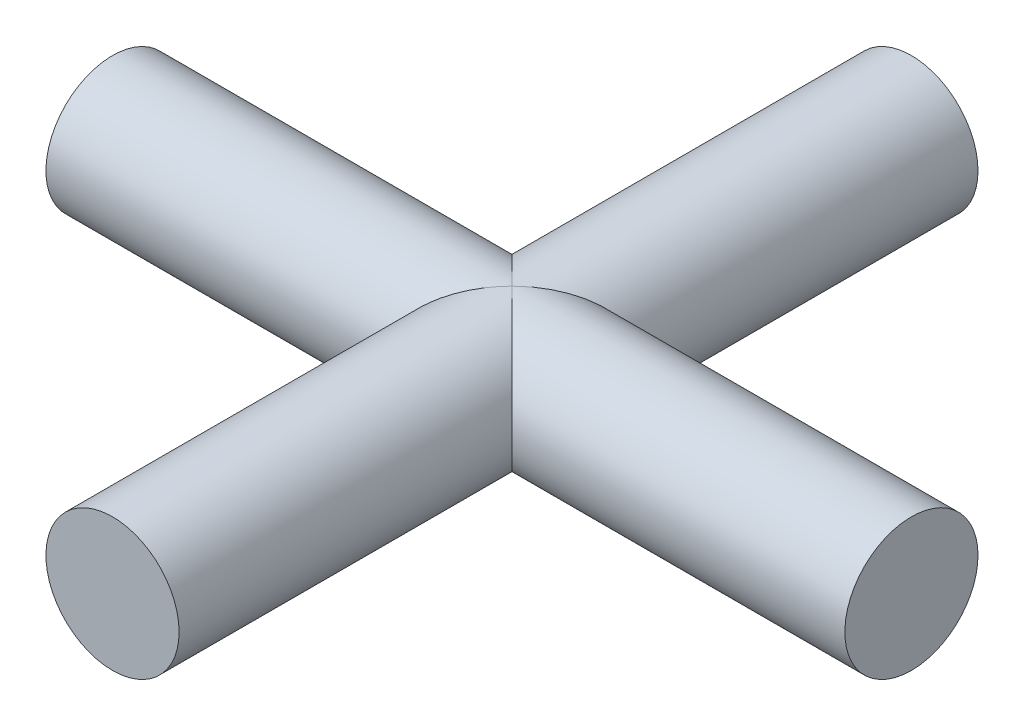
ISO-10303-21;
HEADER;
FILE_DESCRIPTION(('STEP AP214'),'2;1');
FILE_NAME('part.step','',(''),(''),'','','');
FILE_SCHEMA(('AUTOMOTIVE_DESIGN { 1 0 10303 214 1 1 1 1 }'));
ENDSEC;
DATA;
#1=APPLICATION_CONTEXT('core data for automotive mechanical design processes');
#2=APPLICATION_PROTOCOL_DEFINITION('international standard','automotive_design',2000,#1);
#3=PRODUCT_CONTEXT('',#1,'mechanical');
#4=PRODUCT('Part','Part','',(#3));
#5=PRODUCT_RELATED_PRODUCT_CATEGORY('part','',(#4));
#6=PRODUCT_DEFINITION_FORMATION('','',#4);
#7=PRODUCT_DEFINITION_CONTEXT('part definition',#1,'design');
#8=PRODUCT_DEFINITION('design','',#6,#7);
#9=PRODUCT_DEFINITION_SHAPE('','',#8);
#10=(LENGTH_UNIT() NAMED_UNIT(*) SI_UNIT(.MILLI.,.METRE.));
#11=(NAMED_UNIT(*) PLANE_ANGLE_UNIT() SI_UNIT($,.RADIAN.));
#12=(NAMED_UNIT(*) SI_UNIT($,.STERADIAN.) SOLID_ANGLE_UNIT());
#13=UNCERTAINTY_MEASURE_WITH_UNIT(LENGTH_MEASURE(1.E-05),#10,'distance_accuracy_value','');
#14=(GEOMETRIC_REPRESENTATION_CONTEXT(3) GLOBAL_UNCERTAINTY_ASSIGNED_CONTEXT((#13)) GLOBAL_UNIT_ASSIGNED_CONTEXT((#10,
#11,#12)) REPRESENTATION_CONTEXT('',''));
#15=CARTESIAN_POINT('',(0.,0.,0.));
#16=DIRECTION('',(0.,0.,1.));
#17=DIRECTION('',(1.,0.,0.));
#18=AXIS2_PLACEMENT_3D('',#15,#16,#17);
#19=CARTESIAN_POINT('',(0.,0.,15.));
#20=DIRECTION('',(0.,0.,-1.));
#21=DIRECTION('',(-1.,0.,0.));
#22=AXIS2_PLACEMENT_3D('',#19,#20,#21);
#23=CYLINDRICAL_SURFACE('',#22,2.5);
#24=CARTESIAN_POINT('',(0.,0.,15.));
#25=DIRECTION('',(0.,0.,1.));
#26=DIRECTION('',(1.,0.,0.));
#27=AXIS2_PLACEMENT_3D('',#24,#25,#26);
#28=CIRCLE('',#27,2.5);
#29=CARTESIAN_POINT('',(2.5,0.,15.));
#30=VERTEX_POINT('',#29);
#31=EDGE_CURVE('E59',#30,#30,#28,.T.);
#32=ORIENTED_EDGE('',*,*,#31,.F.);
#33=EDGE_LOOP('',(#32));
#34=FACE_BOUND('',#33,.T.);
#35=CARTESIAN_POINT('',(0.,0.,0.));
#36=DIRECTION('',(-0.707106781186547,0.,-0.707106781186547));
#37=DIRECTION('',(0.707106781186547,0.,-0.707106781186547));
#38=AXIS2_PLACEMENT_3D('',#35,#36,#37);
#39=ELLIPSE('',#38,3.53553390593274,2.5);
#40=CARTESIAN_POINT('',(0.,-2.5,0.));
#41=VERTEX_POINT('',#40);
#42=CARTESIAN_POINT('',(0.,2.5,0.));
#43=VERTEX_POINT('',#42);
#44=EDGE_CURVE('E43',#41,#43,#39,.T.);
#45=ORIENTED_EDGE('',*,*,#44,.F.);
#46=CARTESIAN_POINT('',(0.,0.,0.));
#47=DIRECTION('',(0.707106781186547,0.,-0.707106781186547));
#48=DIRECTION('',(-0.707106781186547,0.,-0.707106781186547));
#49=AXIS2_PLACEMENT_3D('',#46,#47,#48);
#50=ELLIPSE('',#49,3.53553390593274,2.5);
#51=EDGE_CURVE('E55',#43,#41,#50,.T.);
#52=ORIENTED_EDGE('',*,*,#51,.F.);
#53=EDGE_LOOP('',(#45,#52));
#54=FACE_BOUND('',#53,.T.);
#55=ADVANCED_FACE('F35',(#34,#54),#23,.T.);
#56=CARTESIAN_POINT('',(0.,0.,15.));
#57=DIRECTION('',(0.,0.,1.));
#58=DIRECTION('',(1.,0.,0.));
#59=AXIS2_PLACEMENT_3D('',#56,#57,#58);
#60=PLANE('',#59);
#61=ORIENTED_EDGE('',*,*,#31,.T.);
#62=EDGE_LOOP('',(#61));
#63=FACE_BOUND('',#62,.T.);
#64=ADVANCED_FACE('F82',(#63),#60,.T.);
#65=CARTESIAN_POINT('',(-15.,0.,0.));
#66=DIRECTION('',(1.,0.,0.));
#67=DIRECTION('',(0.,0.,-1.));
#68=AXIS2_PLACEMENT_3D('',#65,#66,#67);
#69=PLANE('',#68);
#70=CARTESIAN_POINT('',(-15.,0.,0.));
#71=DIRECTION('',(1.,0.,0.));
#72=DIRECTION('',(0.,0.,-1.));
#73=AXIS2_PLACEMENT_3D('',#70,#71,#72);
#74=CIRCLE('',#73,2.5);
#75=CARTESIAN_POINT('',(-15.,0.,-2.5));
#76=VERTEX_POINT('',#75);
#77=EDGE_CURVE('E96',#76,#76,#74,.T.);
#78=ORIENTED_EDGE('',*,*,#77,.F.);
#79=EDGE_LOOP('',(#78));
#80=FACE_BOUND('',#79,.T.);
#81=ADVANCED_FACE('F79',(#80),#69,.F.);
#82=CARTESIAN_POINT('',(15.,0.,0.));
#83=DIRECTION('',(-1.,0.,0.));
#84=DIRECTION('',(0.,0.,1.));
#85=AXIS2_PLACEMENT_3D('',#82,#83,#84);
#86=CYLINDRICAL_SURFACE('',#85,2.5);
#87=ORIENTED_EDGE('',*,*,#77,.T.);
#88=EDGE_LOOP('',(#87));
#89=FACE_BOUND('',#88,.T.);
#90=CARTESIAN_POINT('',(0.,0.,0.));
#91=DIRECTION('',(0.707106781186547,0.,-0.707106781186547));
#92=DIRECTION('',(-0.707106781186547,0.,-0.707106781186547));
#93=AXIS2_PLACEMENT_3D('',#90,#91,#92);
#94=ELLIPSE('',#93,3.53553390593274,2.5);
#95=EDGE_CURVE('E49',#43,#41,#94,.F.);
#96=ORIENTED_EDGE('',*,*,#95,.T.);
#97=ORIENTED_EDGE('',*,*,#44,.T.);
#98=EDGE_LOOP('',(#96,#97));
#99=FACE_BOUND('',#98,.T.);
#100=ADVANCED_FACE('F61',(#89,#99),#86,.T.);
#101=CARTESIAN_POINT('',(0.,0.,-15.));
#102=DIRECTION('',(0.,0.,1.));
#103=DIRECTION('',(1.,0.,0.));
#104=AXIS2_PLACEMENT_3D('',#101,#102,#103);
#105=PLANE('',#104);
#106=CARTESIAN_POINT('',(0.,0.,-15.));
#107=DIRECTION('',(0.,0.,1.));
#108=DIRECTION('',(1.,0.,0.));
#109=AXIS2_PLACEMENT_3D('',#106,#107,#108);
#110=CIRCLE('',#109,2.5);
#111=CARTESIAN_POINT('',(2.5,0.,-15.));
#112=VERTEX_POINT('',#111);
#113=EDGE_CURVE('E90',#112,#112,#110,.T.);
#114=ORIENTED_EDGE('',*,*,#113,.F.);
#115=EDGE_LOOP('',(#114));
#116=FACE_BOUND('',#115,.T.);
#117=ADVANCED_FACE('F73',(#116),#105,.F.);
#118=ORIENTED_EDGE('',*,*,#113,.T.);
#119=EDGE_LOOP('',(#118));
#120=FACE_BOUND('',#119,.T.);
#121=CARTESIAN_POINT('',(0.,0.,0.));
#122=DIRECTION('',(-0.707106781186547,0.,-0.707106781186547));
#123=DIRECTION('',(0.707106781186547,0.,-0.707106781186547));
#124=AXIS2_PLACEMENT_3D('',#121,#122,#123);
#125=ELLIPSE('',#124,3.53553390593274,2.5);
#126=EDGE_CURVE('E11',#41,#43,#125,.F.);
#127=ORIENTED_EDGE('',*,*,#126,.F.);
#128=ORIENTED_EDGE('',*,*,#95,.F.);
#129=EDGE_LOOP('',(#127,#128));
#130=FACE_BOUND('',#129,.T.);
#131=ADVANCED_FACE('F37',(#120,#130),#23,.T.);
#132=CARTESIAN_POINT('',(15.,0.,0.));
#133=DIRECTION('',(1.,0.,0.));
#134=DIRECTION('',(0.,0.,-1.));
#135=AXIS2_PLACEMENT_3D('',#132,#133,#134);
#136=CIRCLE('',#135,2.5);
#137=CARTESIAN_POINT('',(15.,0.,-2.5));
#138=VERTEX_POINT('',#137);
#139=EDGE_CURVE('E93',#138,#138,#136,.T.);
#140=ORIENTED_EDGE('',*,*,#139,.F.);
#141=EDGE_LOOP('',(#140));
#142=FACE_BOUND('',#141,.T.);
#143=ORIENTED_EDGE('',*,*,#51,.T.);
#144=ORIENTED_EDGE('',*,*,#126,.T.);
#145=EDGE_LOOP('',(#143,#144));
#146=FACE_BOUND('',#145,.T.);
#147=ADVANCED_FACE('F62',(#142,#146),#86,.T.);
#148=CARTESIAN_POINT('',(15.,0.,0.));
#149=DIRECTION('',(1.,0.,0.));
#150=DIRECTION('',(0.,0.,-1.));
#151=AXIS2_PLACEMENT_3D('',#148,#149,#150);
#152=PLANE('',#151);
#153=ORIENTED_EDGE('',*,*,#139,.T.);
#154=EDGE_LOOP('',(#153));
#155=FACE_BOUND('',#154,.T.);
#156=ADVANCED_FACE('F64',(#155),#152,.T.);
#157=CLOSED_SHELL('',(#55,#64,#81,#100,#117,#131,#147,#156));
#158=MANIFOLD_SOLID_BREP('B2',#157);
#159=ADVANCED_BREP_SHAPE_REPRESENTATION('',(#18,#158),#14);
#160=SHAPE_DEFINITION_REPRESENTATION(#9,#159);
ENDSEC;
END-ISO-10303-21;
